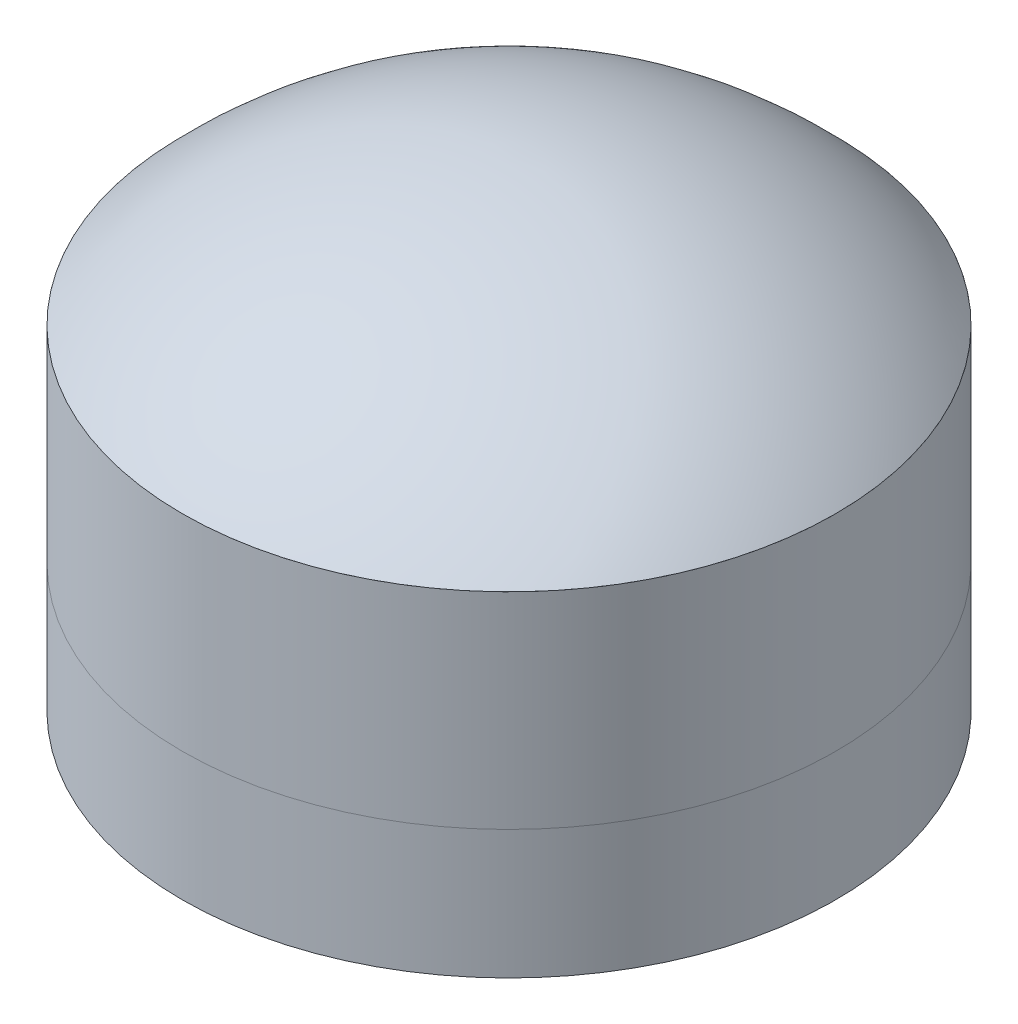
ISO-10303-21;
HEADER;
FILE_DESCRIPTION(('STEP AP214'),'2;1');
FILE_NAME('part.step','',(''),(''),'','','');
FILE_SCHEMA(('AUTOMOTIVE_DESIGN { 1 0 10303 214 1 1 1 1 }'));
ENDSEC;
DATA;
#1=APPLICATION_CONTEXT('core data for automotive mechanical design processes');
#2=APPLICATION_PROTOCOL_DEFINITION('international standard','automotive_design',2000,#1);
#3=PRODUCT_CONTEXT('',#1,'mechanical');
#4=PRODUCT('Part','Part','',(#3));
#5=PRODUCT_RELATED_PRODUCT_CATEGORY('part','',(#4));
#6=PRODUCT_DEFINITION_FORMATION('','',#4);
#7=PRODUCT_DEFINITION_CONTEXT('part definition',#1,'design');
#8=PRODUCT_DEFINITION('design','',#6,#7);
#9=PRODUCT_DEFINITION_SHAPE('','',#8);
#10=(LENGTH_UNIT() NAMED_UNIT(*) SI_UNIT(.MILLI.,.METRE.));
#11=(NAMED_UNIT(*) PLANE_ANGLE_UNIT() SI_UNIT($,.RADIAN.));
#12=(NAMED_UNIT(*) SI_UNIT($,.STERADIAN.) SOLID_ANGLE_UNIT());
#13=UNCERTAINTY_MEASURE_WITH_UNIT(LENGTH_MEASURE(1.E-05),#10,'distance_accuracy_value','');
#14=(GEOMETRIC_REPRESENTATION_CONTEXT(3) GLOBAL_UNCERTAINTY_ASSIGNED_CONTEXT((#13)) GLOBAL_UNIT_ASSIGNED_CONTEXT((#10,
#11,#12)) REPRESENTATION_CONTEXT('',''));
#15=CARTESIAN_POINT('',(0.,0.,0.));
#16=DIRECTION('',(0.,0.,1.));
#17=DIRECTION('',(1.,0.,0.));
#18=AXIS2_PLACEMENT_3D('',#15,#16,#17);
#19=CARTESIAN_POINT('',(0.,0.5,0.));
#20=DIRECTION('',(0.,1.,0.));
#21=DIRECTION('',(1.,0.,0.));
#22=AXIS2_PLACEMENT_3D('',#19,#20,#21);
#23=SPHERICAL_SURFACE('',#22,8.73627494988568);
#24=CARTESIAN_POINT('',(0.,6.5,0.));
#25=DIRECTION('',(0.,1.,0.));
#26=DIRECTION('',(0.,0.,1.));
#27=AXIS2_PLACEMENT_3D('',#24,#25,#26);
#28=CIRCLE('',#27,6.35);
#29=CARTESIAN_POINT('',(0.,6.5,6.35));
#30=VERTEX_POINT('',#29);
#31=EDGE_CURVE('E11',#30,#30,#28,.T.);
#32=ORIENTED_EDGE('',*,*,#31,.T.);
#33=EDGE_LOOP('',(#32));
#34=FACE_BOUND('',#33,.T.);
#35=ADVANCED_FACE('F42',(#34),#23,.T.);
#36=CARTESIAN_POINT('',(6.35,6.5,0.));
#37=DIRECTION('',(0.,1.,0.));
#38=DIRECTION('',(0.,0.,1.));
#39=AXIS2_PLACEMENT_3D('',#36,#37,#38);
#40=PLANE('',#39);
#41=ORIENTED_EDGE('',*,*,#31,.F.);
#42=EDGE_LOOP('',(#41));
#43=FACE_BOUND('',#42,.T.);
#44=ADVANCED_FACE('F50',(#43),#40,.F.);
#45=CLOSED_SHELL('',(#35,#44));
#46=MANIFOLD_SOLID_BREP('B2',#45);
#47=CARTESIAN_POINT('',(0.,6.5,0.));
#48=DIRECTION('',(0.,-1.,0.));
#49=DIRECTION('',(0.,0.,-1.));
#50=AXIS2_PLACEMENT_3D('',#47,#48,#49);
#51=CYLINDRICAL_SURFACE('',#50,6.35);
#52=CARTESIAN_POINT('',(0.,6.5,0.));
#53=DIRECTION('',(0.,1.,0.));
#54=DIRECTION('',(0.,0.,1.));
#55=AXIS2_PLACEMENT_3D('',#52,#53,#54);
#56=CIRCLE('',#55,6.35);
#57=CARTESIAN_POINT('',(0.,6.5,6.35));
#58=VERTEX_POINT('',#57);
#59=EDGE_CURVE('E41',#58,#58,#56,.T.);
#60=ORIENTED_EDGE('',*,*,#59,.F.);
#61=EDGE_LOOP('',(#60));
#62=FACE_BOUND('',#61,.T.);
#63=CARTESIAN_POINT('',(0.,2.5,0.));
#64=DIRECTION('',(0.,1.,0.));
#65=DIRECTION('',(0.,0.,1.));
#66=AXIS2_PLACEMENT_3D('',#63,#64,#65);
#67=CIRCLE('',#66,6.35);
#68=CARTESIAN_POINT('',(0.,2.5,6.35));
#69=VERTEX_POINT('',#68);
#70=EDGE_CURVE('E78',#69,#69,#67,.T.);
#71=ORIENTED_EDGE('',*,*,#70,.T.);
#72=EDGE_LOOP('',(#71));
#73=FACE_BOUND('',#72,.T.);
#74=ADVANCED_FACE('F75',(#62,#73),#51,.T.);
#75=CARTESIAN_POINT('',(0.,6.5,0.));
#76=DIRECTION('',(0.,1.,0.));
#77=DIRECTION('',(0.,0.,1.));
#78=AXIS2_PLACEMENT_3D('',#75,#76,#77);
#79=PLANE('',#78);
#80=ORIENTED_EDGE('',*,*,#59,.T.);
#81=EDGE_LOOP('',(#80));
#82=FACE_BOUND('',#81,.T.);
#83=ADVANCED_FACE('F90',(#82),#79,.T.);
#84=CARTESIAN_POINT('',(0.,2.5,0.));
#85=DIRECTION('',(0.,1.,0.));
#86=DIRECTION('',(0.,0.,1.));
#87=AXIS2_PLACEMENT_3D('',#84,#85,#86);
#88=PLANE('',#87);
#89=ORIENTED_EDGE('',*,*,#70,.F.);
#90=EDGE_LOOP('',(#89));
#91=FACE_BOUND('',#90,.T.);
#92=ADVANCED_FACE('F88',(#91),#88,.F.);
#93=CLOSED_SHELL('',(#74,#83,#92));
#94=MANIFOLD_SOLID_BREP('B6',#93);
#95=CARTESIAN_POINT('',(0.,2.5,0.));
#96=DIRECTION('',(0.,-1.,0.));
#97=DIRECTION('',(0.,0.,-1.));
#98=AXIS2_PLACEMENT_3D('',#95,#96,#97);
#99=CYLINDRICAL_SURFACE('',#98,6.35);
#100=CARTESIAN_POINT('',(0.,2.5,0.));
#101=DIRECTION('',(0.,1.,0.));
#102=DIRECTION('',(0.,0.,1.));
#103=AXIS2_PLACEMENT_3D('',#100,#101,#102);
#104=CIRCLE('',#103,6.35);
#105=CARTESIAN_POINT('',(0.,2.5,6.35));
#106=VERTEX_POINT('',#105);
#107=EDGE_CURVE('E74',#106,#106,#104,.T.);
#108=ORIENTED_EDGE('',*,*,#107,.F.);
#109=EDGE_LOOP('',(#108));
#110=FACE_BOUND('',#109,.T.);
#111=CARTESIAN_POINT('',(0.,0.,0.));
#112=DIRECTION('',(0.,1.,0.));
#113=DIRECTION('',(0.,0.,1.));
#114=AXIS2_PLACEMENT_3D('',#111,#112,#113);
#115=CIRCLE('',#114,6.35);
#116=CARTESIAN_POINT('',(0.,0.,6.35));
#117=VERTEX_POINT('',#116);
#118=EDGE_CURVE('E119',#117,#117,#115,.T.);
#119=ORIENTED_EDGE('',*,*,#118,.T.);
#120=EDGE_LOOP('',(#119));
#121=FACE_BOUND('',#120,.T.);
#122=ADVANCED_FACE('F116',(#110,#121),#99,.T.);
#123=CARTESIAN_POINT('',(0.,2.5,0.));
#124=DIRECTION('',(0.,1.,0.));
#125=DIRECTION('',(0.,0.,1.));
#126=AXIS2_PLACEMENT_3D('',#123,#124,#125);
#127=PLANE('',#126);
#128=ORIENTED_EDGE('',*,*,#107,.T.);
#129=EDGE_LOOP('',(#128));
#130=FACE_BOUND('',#129,.T.);
#131=ADVANCED_FACE('F131',(#130),#127,.T.);
#132=CARTESIAN_POINT('',(0.,0.,0.));
#133=DIRECTION('',(0.,1.,0.));
#134=DIRECTION('',(0.,0.,1.));
#135=AXIS2_PLACEMENT_3D('',#132,#133,#134);
#136=PLANE('',#135);
#137=ORIENTED_EDGE('',*,*,#118,.F.);
#138=EDGE_LOOP('',(#137));
#139=FACE_BOUND('',#138,.T.);
#140=ADVANCED_FACE('F129',(#139),#136,.F.);
#141=CLOSED_SHELL('',(#122,#131,#140));
#142=MANIFOLD_SOLID_BREP('B36',#141);
#143=ADVANCED_BREP_SHAPE_REPRESENTATION('',(#18,#46,#94,#142),#14);
#144=SHAPE_DEFINITION_REPRESENTATION(#9,#143);
ENDSEC;
END-ISO-10303-21;
